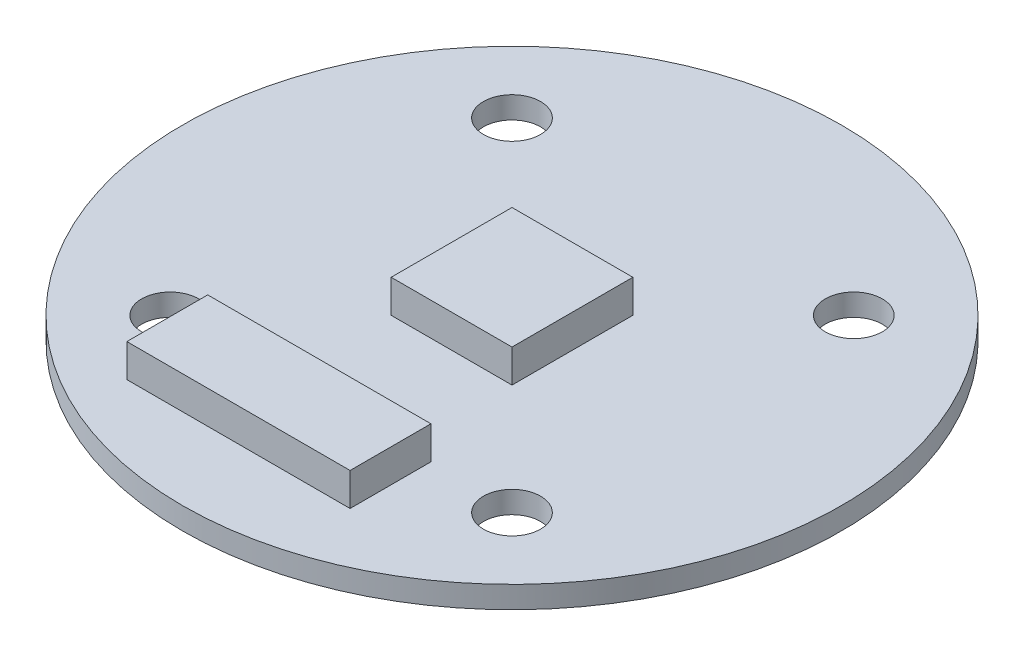
ISO-10303-21;
HEADER;
FILE_DESCRIPTION(('STEP AP214'),'2;1');
FILE_NAME('part.step','',(''),(''),'','','');
FILE_SCHEMA(('AUTOMOTIVE_DESIGN { 1 0 10303 214 1 1 1 1 }'));
ENDSEC;
DATA;
#1=APPLICATION_CONTEXT('core data for automotive mechanical design processes');
#2=APPLICATION_PROTOCOL_DEFINITION('international standard','automotive_design',2000,#1);
#3=PRODUCT_CONTEXT('',#1,'mechanical');
#4=PRODUCT('Part','Part','',(#3));
#5=PRODUCT_RELATED_PRODUCT_CATEGORY('part','',(#4));
#6=PRODUCT_DEFINITION_FORMATION('','',#4);
#7=PRODUCT_DEFINITION_CONTEXT('part definition',#1,'design');
#8=PRODUCT_DEFINITION('design','',#6,#7);
#9=PRODUCT_DEFINITION_SHAPE('','',#8);
#10=(LENGTH_UNIT() NAMED_UNIT(*) SI_UNIT(.MILLI.,.METRE.));
#11=(NAMED_UNIT(*) PLANE_ANGLE_UNIT() SI_UNIT($,.RADIAN.));
#12=(NAMED_UNIT(*) SI_UNIT($,.STERADIAN.) SOLID_ANGLE_UNIT());
#13=UNCERTAINTY_MEASURE_WITH_UNIT(LENGTH_MEASURE(1.E-05),#10,'distance_accuracy_value','');
#14=(GEOMETRIC_REPRESENTATION_CONTEXT(3) GLOBAL_UNCERTAINTY_ASSIGNED_CONTEXT((#13)) GLOBAL_UNIT_ASSIGNED_CONTEXT((#10,
#11,#12)) REPRESENTATION_CONTEXT('',''));
#15=CARTESIAN_POINT('',(0.,0.,0.));
#16=DIRECTION('',(0.,0.,1.));
#17=DIRECTION('',(1.,0.,0.));
#18=AXIS2_PLACEMENT_3D('',#15,#16,#17);
#19=CARTESIAN_POINT('',(7.77817459305198,1.,-7.77817459305251));
#20=DIRECTION('',(0.,-1.,0.));
#21=DIRECTION('',(0.,0.,-1.));
#22=AXIS2_PLACEMENT_3D('',#19,#20,#21);
#23=CYLINDRICAL_SURFACE('',#22,1.3);
#24=CARTESIAN_POINT('',(7.77817459305198,1.,-7.77817459305251));
#25=DIRECTION('',(0.,1.,0.));
#26=DIRECTION('',(0.,0.,1.));
#27=AXIS2_PLACEMENT_3D('',#24,#25,#26);
#28=CIRCLE('',#27,1.3);
#29=CARTESIAN_POINT('',(7.77817459305198,1.,-6.47817459305251));
#30=VERTEX_POINT('',#29);
#31=EDGE_CURVE('E47',#30,#30,#28,.T.);
#32=ORIENTED_EDGE('',*,*,#31,.T.);
#33=EDGE_LOOP('',(#32));
#34=FACE_BOUND('',#33,.T.);
#35=CARTESIAN_POINT('',(7.77817459305198,0.,-7.77817459305251));
#36=DIRECTION('',(0.,1.,0.));
#37=DIRECTION('',(0.,0.,1.));
#38=AXIS2_PLACEMENT_3D('',#35,#36,#37);
#39=CIRCLE('',#38,1.3);
#40=CARTESIAN_POINT('',(7.77817459305198,0.,-6.47817459305251));
#41=VERTEX_POINT('',#40);
#42=EDGE_CURVE('E244',#41,#41,#39,.T.);
#43=ORIENTED_EDGE('',*,*,#42,.F.);
#44=EDGE_LOOP('',(#43));
#45=FACE_BOUND('',#44,.T.);
#46=ADVANCED_FACE('F38',(#34,#45),#23,.F.);
#47=CARTESIAN_POINT('',(7.77817459305251,1.,7.77817459305153));
#48=DIRECTION('',(0.,-1.,0.));
#49=DIRECTION('',(0.,0.,-1.));
#50=AXIS2_PLACEMENT_3D('',#47,#48,#49);
#51=CYLINDRICAL_SURFACE('',#50,1.3);
#52=CARTESIAN_POINT('',(7.77817459305251,1.,7.77817459305153));
#53=DIRECTION('',(0.,1.,0.));
#54=DIRECTION('',(0.,0.,1.));
#55=AXIS2_PLACEMENT_3D('',#52,#53,#54);
#56=CIRCLE('',#55,1.3);
#57=CARTESIAN_POINT('',(7.77817459305251,1.,9.07817459305153));
#58=VERTEX_POINT('',#57);
#59=EDGE_CURVE('E232',#58,#58,#56,.T.);
#60=ORIENTED_EDGE('',*,*,#59,.T.);
#61=EDGE_LOOP('',(#60));
#62=FACE_BOUND('',#61,.T.);
#63=CARTESIAN_POINT('',(7.77817459305251,0.,7.77817459305153));
#64=DIRECTION('',(0.,1.,0.));
#65=DIRECTION('',(0.,0.,1.));
#66=AXIS2_PLACEMENT_3D('',#63,#64,#65);
#67=CIRCLE('',#66,1.3);
#68=CARTESIAN_POINT('',(7.77817459305251,0.,9.07817459305153));
#69=VERTEX_POINT('',#68);
#70=EDGE_CURVE('E242',#69,#69,#67,.T.);
#71=ORIENTED_EDGE('',*,*,#70,.F.);
#72=EDGE_LOOP('',(#71));
#73=FACE_BOUND('',#72,.T.);
#74=ADVANCED_FACE('F270',(#62,#73),#51,.F.);
#75=CARTESIAN_POINT('',(-7.77817459305153,1.,7.77817459305207));
#76=DIRECTION('',(0.,-1.,0.));
#77=DIRECTION('',(0.,0.,-1.));
#78=AXIS2_PLACEMENT_3D('',#75,#76,#77);
#79=CYLINDRICAL_SURFACE('',#78,1.3);
#80=CARTESIAN_POINT('',(-7.77817459305153,1.,7.77817459305207));
#81=DIRECTION('',(0.,1.,0.));
#82=DIRECTION('',(0.,0.,1.));
#83=AXIS2_PLACEMENT_3D('',#80,#81,#82);
#84=CIRCLE('',#83,1.3);
#85=CARTESIAN_POINT('',(-7.77817459305153,1.,9.07817459305207));
#86=VERTEX_POINT('',#85);
#87=EDGE_CURVE('E229',#86,#86,#84,.T.);
#88=ORIENTED_EDGE('',*,*,#87,.T.);
#89=EDGE_LOOP('',(#88));
#90=FACE_BOUND('',#89,.T.);
#91=CARTESIAN_POINT('',(-7.77817459305153,0.,7.77817459305207));
#92=DIRECTION('',(0.,1.,0.));
#93=DIRECTION('',(0.,0.,1.));
#94=AXIS2_PLACEMENT_3D('',#91,#92,#93);
#95=CIRCLE('',#94,1.3);
#96=CARTESIAN_POINT('',(-7.77817459305153,0.,9.07817459305207));
#97=VERTEX_POINT('',#96);
#98=EDGE_CURVE('E239',#97,#97,#95,.T.);
#99=ORIENTED_EDGE('',*,*,#98,.F.);
#100=EDGE_LOOP('',(#99));
#101=FACE_BOUND('',#100,.T.);
#102=ADVANCED_FACE('F276',(#90,#101),#79,.F.);
#103=CARTESIAN_POINT('',(-7.77817459305206,1.,-7.77817459305198));
#104=DIRECTION('',(0.,-1.,0.));
#105=DIRECTION('',(0.,0.,-1.));
#106=AXIS2_PLACEMENT_3D('',#103,#104,#105);
#107=CYLINDRICAL_SURFACE('',#106,1.3);
#108=CARTESIAN_POINT('',(-7.77817459305206,1.,-7.77817459305198));
#109=DIRECTION('',(0.,1.,0.));
#110=DIRECTION('',(0.,0.,1.));
#111=AXIS2_PLACEMENT_3D('',#108,#109,#110);
#112=CIRCLE('',#111,1.3);
#113=CARTESIAN_POINT('',(-7.77817459305206,1.,-6.47817459305198));
#114=VERTEX_POINT('',#113);
#115=EDGE_CURVE('E226',#114,#114,#112,.T.);
#116=ORIENTED_EDGE('',*,*,#115,.T.);
#117=EDGE_LOOP('',(#116));
#118=FACE_BOUND('',#117,.T.);
#119=CARTESIAN_POINT('',(-7.77817459305206,0.,-7.77817459305198));
#120=DIRECTION('',(0.,1.,0.));
#121=DIRECTION('',(0.,0.,1.));
#122=AXIS2_PLACEMENT_3D('',#119,#120,#121);
#123=CIRCLE('',#122,1.3);
#124=CARTESIAN_POINT('',(-7.77817459305206,0.,-6.47817459305198));
#125=VERTEX_POINT('',#124);
#126=EDGE_CURVE('E225',#125,#125,#123,.T.);
#127=ORIENTED_EDGE('',*,*,#126,.F.);
#128=EDGE_LOOP('',(#127));
#129=FACE_BOUND('',#128,.T.);
#130=ADVANCED_FACE('F40',(#118,#129),#107,.F.);
#131=CARTESIAN_POINT('',(0.,1.,0.));
#132=DIRECTION('',(0.,-1.,0.));
#133=DIRECTION('',(0.,0.,-1.));
#134=AXIS2_PLACEMENT_3D('',#131,#132,#133);
#135=CYLINDRICAL_SURFACE('',#134,15.);
#136=CARTESIAN_POINT('',(0.,1.,0.));
#137=DIRECTION('',(0.,1.,0.));
#138=DIRECTION('',(0.,0.,1.));
#139=AXIS2_PLACEMENT_3D('',#136,#137,#138);
#140=CIRCLE('',#139,15.);
#141=CARTESIAN_POINT('',(0.,1.,15.));
#142=VERTEX_POINT('',#141);
#143=EDGE_CURVE('E11',#142,#142,#140,.T.);
#144=ORIENTED_EDGE('',*,*,#143,.F.);
#145=EDGE_LOOP('',(#144));
#146=FACE_BOUND('',#145,.T.);
#147=CARTESIAN_POINT('',(0.,0.,0.));
#148=DIRECTION('',(0.,1.,0.));
#149=DIRECTION('',(0.,0.,1.));
#150=AXIS2_PLACEMENT_3D('',#147,#148,#149);
#151=CIRCLE('',#150,15.);
#152=CARTESIAN_POINT('',(0.,0.,15.));
#153=VERTEX_POINT('',#152);
#154=EDGE_CURVE('E42',#153,#153,#151,.T.);
#155=ORIENTED_EDGE('',*,*,#154,.T.);
#156=EDGE_LOOP('',(#155));
#157=FACE_BOUND('',#156,.T.);
#158=ADVANCED_FACE('F251',(#146,#157),#135,.T.);
#159=CARTESIAN_POINT('',(0.,1.,0.));
#160=DIRECTION('',(0.,1.,0.));
#161=DIRECTION('',(0.,0.,1.));
#162=AXIS2_PLACEMENT_3D('',#159,#160,#161);
#163=PLANE('',#162);
#164=DIRECTION('',(0.,0.,1.));
#165=VECTOR('',#164,1.);
#166=CARTESIAN_POINT('',(3.93,1.,0.));
#167=LINE('',#166,#165);
#168=CARTESIAN_POINT('',(3.93,1.,7.62));
#169=VERTEX_POINT('',#168);
#170=CARTESIAN_POINT('',(3.93,1.,11.3));
#171=VERTEX_POINT('',#170);
#172=EDGE_CURVE('E136',#169,#171,#167,.T.);
#173=ORIENTED_EDGE('',*,*,#172,.T.);
#174=DIRECTION('',(1.,0.,0.));
#175=VECTOR('',#174,1.);
#176=CARTESIAN_POINT('',(0.,1.,11.3));
#177=LINE('',#176,#175);
#178=CARTESIAN_POINT('',(-6.23,1.,11.3));
#179=VERTEX_POINT('',#178);
#180=EDGE_CURVE('E170',#179,#171,#177,.T.);
#181=ORIENTED_EDGE('',*,*,#180,.F.);
#182=DIRECTION('',(0.,0.,1.));
#183=VECTOR('',#182,1.);
#184=CARTESIAN_POINT('',(-6.23,1.,0.));
#185=LINE('',#184,#183);
#186=CARTESIAN_POINT('',(-6.23,1.,7.62));
#187=VERTEX_POINT('',#186);
#188=EDGE_CURVE('E183',#187,#179,#185,.T.);
#189=ORIENTED_EDGE('',*,*,#188,.F.);
#190=DIRECTION('',(1.,0.,0.));
#191=VECTOR('',#190,1.);
#192=CARTESIAN_POINT('',(0.,1.,7.62));
#193=LINE('',#192,#191);
#194=EDGE_CURVE('E180',#187,#169,#193,.T.);
#195=ORIENTED_EDGE('',*,*,#194,.T.);
#196=EDGE_LOOP('',(#173,#181,#189,#195));
#197=FACE_BOUND('',#196,.T.);
#198=DIRECTION('',(0.,0.,-1.));
#199=VECTOR('',#198,1.);
#200=CARTESIAN_POINT('',(-2.75,1.,0.));
#201=LINE('',#200,#199);
#202=CARTESIAN_POINT('',(-2.75,1.,2.75));
#203=VERTEX_POINT('',#202);
#204=CARTESIAN_POINT('',(-2.75,1.,-2.75));
#205=VERTEX_POINT('',#204);
#206=EDGE_CURVE('E195',#203,#205,#201,.T.);
#207=ORIENTED_EDGE('',*,*,#206,.T.);
#208=DIRECTION('',(-1.,0.,0.));
#209=VECTOR('',#208,1.);
#210=CARTESIAN_POINT('',(0.,1.,-2.75));
#211=LINE('',#210,#209);
#212=CARTESIAN_POINT('',(2.75,1.,-2.75));
#213=VERTEX_POINT('',#212);
#214=EDGE_CURVE('E200',#213,#205,#211,.T.);
#215=ORIENTED_EDGE('',*,*,#214,.F.);
#216=DIRECTION('',(0.,0.,-1.));
#217=VECTOR('',#216,1.);
#218=CARTESIAN_POINT('',(2.75,1.,0.));
#219=LINE('',#218,#217);
#220=CARTESIAN_POINT('',(2.75,1.,2.75));
#221=VERTEX_POINT('',#220);
#222=EDGE_CURVE('E213',#221,#213,#219,.T.);
#223=ORIENTED_EDGE('',*,*,#222,.F.);
#224=DIRECTION('',(-1.,0.,0.));
#225=VECTOR('',#224,1.);
#226=CARTESIAN_POINT('',(0.,1.,2.75));
#227=LINE('',#226,#225);
#228=EDGE_CURVE('E210',#221,#203,#227,.T.);
#229=ORIENTED_EDGE('',*,*,#228,.T.);
#230=EDGE_LOOP('',(#207,#215,#223,#229));
#231=FACE_BOUND('',#230,.T.);
#232=ORIENTED_EDGE('',*,*,#115,.F.);
#233=EDGE_LOOP('',(#232));
#234=FACE_BOUND('',#233,.T.);
#235=ORIENTED_EDGE('',*,*,#87,.F.);
#236=EDGE_LOOP('',(#235));
#237=FACE_BOUND('',#236,.T.);
#238=ORIENTED_EDGE('',*,*,#59,.F.);
#239=EDGE_LOOP('',(#238));
#240=FACE_BOUND('',#239,.T.);
#241=ORIENTED_EDGE('',*,*,#31,.F.);
#242=EDGE_LOOP('',(#241));
#243=FACE_BOUND('',#242,.T.);
#244=ORIENTED_EDGE('',*,*,#143,.T.);
#245=EDGE_LOOP('',(#244));
#246=FACE_BOUND('',#245,.T.);
#247=ADVANCED_FACE('F256',(#197,#231,#234,#237,#240,#243,#246),#163,.T.);
#248=CARTESIAN_POINT('',(0.,0.,0.));
#249=DIRECTION('',(0.,1.,0.));
#250=DIRECTION('',(0.,0.,1.));
#251=AXIS2_PLACEMENT_3D('',#248,#249,#250);
#252=PLANE('',#251);
#253=DIRECTION('',(-1.,0.,0.));
#254=VECTOR('',#253,1.);
#255=CARTESIAN_POINT('',(0.,0.,-1.685));
#256=LINE('',#255,#254);
#257=CARTESIAN_POINT('',(2.5,0.,-1.685));
#258=VERTEX_POINT('',#257);
#259=CARTESIAN_POINT('',(-2.5,0.,-1.685));
#260=VERTEX_POINT('',#259);
#261=EDGE_CURVE('E55',#258,#260,#256,.T.);
#262=ORIENTED_EDGE('',*,*,#261,.T.);
#263=DIRECTION('',(0.,0.,1.));
#264=VECTOR('',#263,1.);
#265=CARTESIAN_POINT('',(-2.5,0.,0.));
#266=LINE('',#265,#264);
#267=CARTESIAN_POINT('',(-2.5,0.,1.685));
#268=VERTEX_POINT('',#267);
#269=EDGE_CURVE('E133',#260,#268,#266,.T.);
#270=ORIENTED_EDGE('',*,*,#269,.T.);
#271=DIRECTION('',(-1.,0.,0.));
#272=VECTOR('',#271,1.);
#273=CARTESIAN_POINT('',(0.,0.,1.685));
#274=LINE('',#273,#272);
#275=CARTESIAN_POINT('',(2.5,0.,1.685));
#276=VERTEX_POINT('',#275);
#277=EDGE_CURVE('E146',#276,#268,#274,.T.);
#278=ORIENTED_EDGE('',*,*,#277,.F.);
#279=DIRECTION('',(0.,0.,1.));
#280=VECTOR('',#279,1.);
#281=CARTESIAN_POINT('',(2.5,0.,0.));
#282=LINE('',#281,#280);
#283=EDGE_CURVE('E60',#258,#276,#282,.T.);
#284=ORIENTED_EDGE('',*,*,#283,.F.);
#285=EDGE_LOOP('',(#262,#270,#278,#284));
#286=FACE_BOUND('',#285,.T.);
#287=ORIENTED_EDGE('',*,*,#126,.T.);
#288=EDGE_LOOP('',(#287));
#289=FACE_BOUND('',#288,.T.);
#290=ORIENTED_EDGE('',*,*,#98,.T.);
#291=EDGE_LOOP('',(#290));
#292=FACE_BOUND('',#291,.T.);
#293=ORIENTED_EDGE('',*,*,#70,.T.);
#294=EDGE_LOOP('',(#293));
#295=FACE_BOUND('',#294,.T.);
#296=ORIENTED_EDGE('',*,*,#42,.T.);
#297=EDGE_LOOP('',(#296));
#298=FACE_BOUND('',#297,.T.);
#299=ORIENTED_EDGE('',*,*,#154,.F.);
#300=EDGE_LOOP('',(#299));
#301=FACE_BOUND('',#300,.T.);
#302=ADVANCED_FACE('F253',(#286,#289,#292,#295,#298,#301),#252,.F.);
#303=CARTESIAN_POINT('',(-2.75,2.5,0.));
#304=DIRECTION('',(-1.,0.,0.));
#305=DIRECTION('',(0.,0.,1.));
#306=AXIS2_PLACEMENT_3D('',#303,#304,#305);
#307=PLANE('',#306);
#308=ORIENTED_EDGE('',*,*,#206,.F.);
#309=DIRECTION('',(0.,-1.,0.));
#310=VECTOR('',#309,1.);
#311=CARTESIAN_POINT('',(-2.75,2.5,2.75));
#312=LINE('',#311,#310);
#313=CARTESIAN_POINT('',(-2.75,2.5,2.75));
#314=VERTEX_POINT('',#313);
#315=EDGE_CURVE('E223',#314,#203,#312,.T.);
#316=ORIENTED_EDGE('',*,*,#315,.F.);
#317=DIRECTION('',(0.,0.,-1.));
#318=VECTOR('',#317,1.);
#319=CARTESIAN_POINT('',(-2.75,2.5,0.));
#320=LINE('',#319,#318);
#321=CARTESIAN_POINT('',(-2.75,2.5,-2.75));
#322=VERTEX_POINT('',#321);
#323=EDGE_CURVE('E196',#314,#322,#320,.T.);
#324=ORIENTED_EDGE('',*,*,#323,.T.);
#325=DIRECTION('',(0.,-1.,0.));
#326=VECTOR('',#325,1.);
#327=CARTESIAN_POINT('',(-2.75,2.5,-2.75));
#328=LINE('',#327,#326);
#329=EDGE_CURVE('E207',#322,#205,#328,.T.);
#330=ORIENTED_EDGE('',*,*,#329,.T.);
#331=EDGE_LOOP('',(#308,#316,#324,#330));
#332=FACE_BOUND('',#331,.T.);
#333=ADVANCED_FACE('F255',(#332),#307,.T.);
#334=CARTESIAN_POINT('',(0.,2.5,2.75));
#335=DIRECTION('',(0.,0.,1.));
#336=DIRECTION('',(1.,0.,0.));
#337=AXIS2_PLACEMENT_3D('',#334,#335,#336);
#338=PLANE('',#337);
#339=ORIENTED_EDGE('',*,*,#228,.F.);
#340=DIRECTION('',(0.,-1.,0.));
#341=VECTOR('',#340,1.);
#342=CARTESIAN_POINT('',(2.75,2.5,2.75));
#343=LINE('',#342,#341);
#344=CARTESIAN_POINT('',(2.75,2.5,2.75));
#345=VERTEX_POINT('',#344);
#346=EDGE_CURVE('E221',#345,#221,#343,.T.);
#347=ORIENTED_EDGE('',*,*,#346,.F.);
#348=DIRECTION('',(-1.,0.,0.));
#349=VECTOR('',#348,1.);
#350=CARTESIAN_POINT('',(0.,2.5,2.75));
#351=LINE('',#350,#349);
#352=EDGE_CURVE('E199',#345,#314,#351,.T.);
#353=ORIENTED_EDGE('',*,*,#352,.T.);
#354=ORIENTED_EDGE('',*,*,#315,.T.);
#355=EDGE_LOOP('',(#339,#347,#353,#354));
#356=FACE_BOUND('',#355,.T.);
#357=ADVANCED_FACE('F262',(#356),#338,.T.);
#358=CARTESIAN_POINT('',(2.75,2.5,0.));
#359=DIRECTION('',(-1.,0.,0.));
#360=DIRECTION('',(0.,0.,1.));
#361=AXIS2_PLACEMENT_3D('',#358,#359,#360);
#362=PLANE('',#361);
#363=ORIENTED_EDGE('',*,*,#222,.T.);
#364=DIRECTION('',(0.,-1.,0.));
#365=VECTOR('',#364,1.);
#366=CARTESIAN_POINT('',(2.75,2.5,-2.75));
#367=LINE('',#366,#365);
#368=CARTESIAN_POINT('',(2.75,2.5,-2.75));
#369=VERTEX_POINT('',#368);
#370=EDGE_CURVE('E219',#369,#213,#367,.T.);
#371=ORIENTED_EDGE('',*,*,#370,.F.);
#372=DIRECTION('',(0.,0.,-1.));
#373=VECTOR('',#372,1.);
#374=CARTESIAN_POINT('',(2.75,2.5,0.));
#375=LINE('',#374,#373);
#376=EDGE_CURVE('E203',#345,#369,#375,.T.);
#377=ORIENTED_EDGE('',*,*,#376,.F.);
#378=ORIENTED_EDGE('',*,*,#346,.T.);
#379=EDGE_LOOP('',(#363,#371,#377,#378));
#380=FACE_BOUND('',#379,.T.);
#381=ADVANCED_FACE('F363',(#380),#362,.F.);
#382=CARTESIAN_POINT('',(0.,2.5,-2.75));
#383=DIRECTION('',(0.,0.,1.));
#384=DIRECTION('',(1.,0.,0.));
#385=AXIS2_PLACEMENT_3D('',#382,#383,#384);
#386=PLANE('',#385);
#387=ORIENTED_EDGE('',*,*,#214,.T.);
#388=ORIENTED_EDGE('',*,*,#329,.F.);
#389=DIRECTION('',(-1.,0.,0.));
#390=VECTOR('',#389,1.);
#391=CARTESIAN_POINT('',(0.,2.5,-2.75));
#392=LINE('',#391,#390);
#393=EDGE_CURVE('E205',#369,#322,#392,.T.);
#394=ORIENTED_EDGE('',*,*,#393,.F.);
#395=ORIENTED_EDGE('',*,*,#370,.T.);
#396=EDGE_LOOP('',(#387,#388,#394,#395));
#397=FACE_BOUND('',#396,.T.);
#398=ADVANCED_FACE('F373',(#397),#386,.F.);
#399=CARTESIAN_POINT('',(0.,2.5,0.));
#400=DIRECTION('',(0.,1.,0.));
#401=DIRECTION('',(0.,0.,1.));
#402=AXIS2_PLACEMENT_3D('',#399,#400,#401);
#403=PLANE('',#402);
#404=ORIENTED_EDGE('',*,*,#323,.F.);
#405=ORIENTED_EDGE('',*,*,#352,.F.);
#406=ORIENTED_EDGE('',*,*,#376,.T.);
#407=ORIENTED_EDGE('',*,*,#393,.T.);
#408=EDGE_LOOP('',(#404,#405,#406,#407));
#409=FACE_BOUND('',#408,.T.);
#410=ADVANCED_FACE('F383',(#409),#403,.T.);
#411=CARTESIAN_POINT('',(3.93,2.5,0.));
#412=DIRECTION('',(1.,0.,0.));
#413=DIRECTION('',(0.,0.,-1.));
#414=AXIS2_PLACEMENT_3D('',#411,#412,#413);
#415=PLANE('',#414);
#416=ORIENTED_EDGE('',*,*,#172,.F.);
#417=DIRECTION('',(0.,-1.,0.));
#418=VECTOR('',#417,1.);
#419=CARTESIAN_POINT('',(3.93,2.5,7.62));
#420=LINE('',#419,#418);
#421=CARTESIAN_POINT('',(3.93,2.5,7.62));
#422=VERTEX_POINT('',#421);
#423=EDGE_CURVE('E193',#422,#169,#420,.T.);
#424=ORIENTED_EDGE('',*,*,#423,.F.);
#425=DIRECTION('',(0.,0.,1.));
#426=VECTOR('',#425,1.);
#427=CARTESIAN_POINT('',(3.93,2.5,0.));
#428=LINE('',#427,#426);
#429=CARTESIAN_POINT('',(3.93,2.5,11.3));
#430=VERTEX_POINT('',#429);
#431=EDGE_CURVE('E166',#422,#430,#428,.T.);
#432=ORIENTED_EDGE('',*,*,#431,.T.);
#433=DIRECTION('',(0.,-1.,0.));
#434=VECTOR('',#433,1.);
#435=CARTESIAN_POINT('',(3.93,2.5,11.3));
#436=LINE('',#435,#434);
#437=EDGE_CURVE('E177',#430,#171,#436,.T.);
#438=ORIENTED_EDGE('',*,*,#437,.T.);
#439=EDGE_LOOP('',(#416,#424,#432,#438));
#440=FACE_BOUND('',#439,.T.);
#441=ADVANCED_FACE('F393',(#440),#415,.T.);
#442=CARTESIAN_POINT('',(0.,2.5,7.62));
#443=DIRECTION('',(0.,0.,-1.));
#444=DIRECTION('',(-1.,0.,0.));
#445=AXIS2_PLACEMENT_3D('',#442,#443,#444);
#446=PLANE('',#445);
#447=ORIENTED_EDGE('',*,*,#194,.F.);
#448=DIRECTION('',(0.,-1.,0.));
#449=VECTOR('',#448,1.);
#450=CARTESIAN_POINT('',(-6.23,2.5,7.62));
#451=LINE('',#450,#449);
#452=CARTESIAN_POINT('',(-6.23,2.5,7.62));
#453=VERTEX_POINT('',#452);
#454=EDGE_CURVE('E191',#453,#187,#451,.T.);
#455=ORIENTED_EDGE('',*,*,#454,.F.);
#456=DIRECTION('',(1.,0.,0.));
#457=VECTOR('',#456,1.);
#458=CARTESIAN_POINT('',(0.,2.5,7.62));
#459=LINE('',#458,#457);
#460=EDGE_CURVE('E169',#453,#422,#459,.T.);
#461=ORIENTED_EDGE('',*,*,#460,.T.);
#462=ORIENTED_EDGE('',*,*,#423,.T.);
#463=EDGE_LOOP('',(#447,#455,#461,#462));
#464=FACE_BOUND('',#463,.T.);
#465=ADVANCED_FACE('F403',(#464),#446,.T.);
#466=CARTESIAN_POINT('',(-6.23,2.5,0.));
#467=DIRECTION('',(1.,0.,0.));
#468=DIRECTION('',(0.,0.,-1.));
#469=AXIS2_PLACEMENT_3D('',#466,#467,#468);
#470=PLANE('',#469);
#471=ORIENTED_EDGE('',*,*,#188,.T.);
#472=DIRECTION('',(0.,-1.,0.));
#473=VECTOR('',#472,1.);
#474=CARTESIAN_POINT('',(-6.23,2.5,11.3));
#475=LINE('',#474,#473);
#476=CARTESIAN_POINT('',(-6.23,2.5,11.3));
#477=VERTEX_POINT('',#476);
#478=EDGE_CURVE('E189',#477,#179,#475,.T.);
#479=ORIENTED_EDGE('',*,*,#478,.F.);
#480=DIRECTION('',(0.,0.,1.));
#481=VECTOR('',#480,1.);
#482=CARTESIAN_POINT('',(-6.23,2.5,0.));
#483=LINE('',#482,#481);
#484=EDGE_CURVE('E173',#453,#477,#483,.T.);
#485=ORIENTED_EDGE('',*,*,#484,.F.);
#486=ORIENTED_EDGE('',*,*,#454,.T.);
#487=EDGE_LOOP('',(#471,#479,#485,#486));
#488=FACE_BOUND('',#487,.T.);
#489=ADVANCED_FACE('F413',(#488),#470,.F.);
#490=CARTESIAN_POINT('',(0.,2.5,11.3));
#491=DIRECTION('',(0.,0.,-1.));
#492=DIRECTION('',(-1.,0.,0.));
#493=AXIS2_PLACEMENT_3D('',#490,#491,#492);
#494=PLANE('',#493);
#495=ORIENTED_EDGE('',*,*,#180,.T.);
#496=ORIENTED_EDGE('',*,*,#437,.F.);
#497=DIRECTION('',(1.,0.,0.));
#498=VECTOR('',#497,1.);
#499=CARTESIAN_POINT('',(0.,2.5,11.3));
#500=LINE('',#499,#498);
#501=EDGE_CURVE('E175',#477,#430,#500,.T.);
#502=ORIENTED_EDGE('',*,*,#501,.F.);
#503=ORIENTED_EDGE('',*,*,#478,.T.);
#504=EDGE_LOOP('',(#495,#496,#502,#503));
#505=FACE_BOUND('',#504,.T.);
#506=ADVANCED_FACE('F423',(#505),#494,.F.);
#507=CARTESIAN_POINT('',(0.,2.5,0.));
#508=DIRECTION('',(0.,1.,0.));
#509=DIRECTION('',(0.,0.,1.));
#510=AXIS2_PLACEMENT_3D('',#507,#508,#509);
#511=PLANE('',#510);
#512=ORIENTED_EDGE('',*,*,#431,.F.);
#513=ORIENTED_EDGE('',*,*,#460,.F.);
#514=ORIENTED_EDGE('',*,*,#484,.T.);
#515=ORIENTED_EDGE('',*,*,#501,.T.);
#516=EDGE_LOOP('',(#512,#513,#514,#515));
#517=FACE_BOUND('',#516,.T.);
#518=ADVANCED_FACE('F433',(#517),#511,.T.);
#519=CARTESIAN_POINT('',(-2.5,-1.5,0.));
#520=DIRECTION('',(-1.,0.,0.));
#521=DIRECTION('',(0.,0.,1.));
#522=AXIS2_PLACEMENT_3D('',#519,#520,#521);
#523=PLANE('',#522);
#524=ORIENTED_EDGE('',*,*,#269,.F.);
#525=DIRECTION('',(0.,1.,0.));
#526=VECTOR('',#525,1.);
#527=CARTESIAN_POINT('',(-2.5,-1.5,-1.685));
#528=LINE('',#527,#526);
#529=CARTESIAN_POINT('',(-2.5,-1.5,-1.685));
#530=VERTEX_POINT('',#529);
#531=EDGE_CURVE('E128',#530,#260,#528,.T.);
#532=ORIENTED_EDGE('',*,*,#531,.F.);
#533=DIRECTION('',(0.,0.,1.));
#534=VECTOR('',#533,1.);
#535=CARTESIAN_POINT('',(-2.5,-1.5,0.));
#536=LINE('',#535,#534);
#537=CARTESIAN_POINT('',(-2.5,-1.5,1.685));
#538=VERTEX_POINT('',#537);
#539=EDGE_CURVE('E132',#530,#538,#536,.T.);
#540=ORIENTED_EDGE('',*,*,#539,.T.);
#541=DIRECTION('',(0.,1.,0.));
#542=VECTOR('',#541,1.);
#543=CARTESIAN_POINT('',(-2.5,-1.5,1.685));
#544=LINE('',#543,#542);
#545=EDGE_CURVE('E155',#538,#268,#544,.T.);
#546=ORIENTED_EDGE('',*,*,#545,.T.);
#547=EDGE_LOOP('',(#524,#532,#540,#546));
#548=FACE_BOUND('',#547,.T.);
#549=ADVANCED_FACE('F130',(#548),#523,.T.);
#550=CARTESIAN_POINT('',(0.,-1.5,-1.685));
#551=DIRECTION('',(0.,0.,-1.));
#552=DIRECTION('',(-1.,0.,0.));
#553=AXIS2_PLACEMENT_3D('',#550,#551,#552);
#554=PLANE('',#553);
#555=ORIENTED_EDGE('',*,*,#261,.F.);
#556=DIRECTION('',(0.,1.,0.));
#557=VECTOR('',#556,1.);
#558=CARTESIAN_POINT('',(2.5,-1.5,-1.685));
#559=LINE('',#558,#557);
#560=CARTESIAN_POINT('',(2.5,-1.5,-1.685));
#561=VERTEX_POINT('',#560);
#562=EDGE_CURVE('E137',#561,#258,#559,.T.);
#563=ORIENTED_EDGE('',*,*,#562,.F.);
#564=DIRECTION('',(-1.,0.,0.));
#565=VECTOR('',#564,1.);
#566=CARTESIAN_POINT('',(0.,-1.5,-1.685));
#567=LINE('',#566,#565);
#568=EDGE_CURVE('E142',#561,#530,#567,.T.);
#569=ORIENTED_EDGE('',*,*,#568,.T.);
#570=ORIENTED_EDGE('',*,*,#531,.T.);
#571=EDGE_LOOP('',(#555,#563,#569,#570));
#572=FACE_BOUND('',#571,.T.);
#573=ADVANCED_FACE('F148',(#572),#554,.T.);
#574=CARTESIAN_POINT('',(2.5,-1.5,0.));
#575=DIRECTION('',(-1.,0.,0.));
#576=DIRECTION('',(0.,0.,1.));
#577=AXIS2_PLACEMENT_3D('',#574,#575,#576);
#578=PLANE('',#577);
#579=ORIENTED_EDGE('',*,*,#283,.T.);
#580=DIRECTION('',(0.,1.,0.));
#581=VECTOR('',#580,1.);
#582=CARTESIAN_POINT('',(2.5,-1.5,1.685));
#583=LINE('',#582,#581);
#584=CARTESIAN_POINT('',(2.5,-1.5,1.685));
#585=VERTEX_POINT('',#584);
#586=EDGE_CURVE('E162',#585,#276,#583,.T.);
#587=ORIENTED_EDGE('',*,*,#586,.F.);
#588=DIRECTION('',(0.,0.,1.));
#589=VECTOR('',#588,1.);
#590=CARTESIAN_POINT('',(2.5,-1.5,0.));
#591=LINE('',#590,#589);
#592=EDGE_CURVE('E150',#561,#585,#591,.T.);
#593=ORIENTED_EDGE('',*,*,#592,.F.);
#594=ORIENTED_EDGE('',*,*,#562,.T.);
#595=EDGE_LOOP('',(#579,#587,#593,#594));
#596=FACE_BOUND('',#595,.T.);
#597=ADVANCED_FACE('F458',(#596),#578,.F.);
#598=CARTESIAN_POINT('',(0.,-1.5,1.685));
#599=DIRECTION('',(0.,0.,-1.));
#600=DIRECTION('',(-1.,0.,0.));
#601=AXIS2_PLACEMENT_3D('',#598,#599,#600);
#602=PLANE('',#601);
#603=ORIENTED_EDGE('',*,*,#277,.T.);
#604=ORIENTED_EDGE('',*,*,#545,.F.);
#605=DIRECTION('',(-1.,0.,0.));
#606=VECTOR('',#605,1.);
#607=CARTESIAN_POINT('',(0.,-1.5,1.685));
#608=LINE('',#607,#606);
#609=EDGE_CURVE('E144',#585,#538,#608,.T.);
#610=ORIENTED_EDGE('',*,*,#609,.F.);
#611=ORIENTED_EDGE('',*,*,#586,.T.);
#612=EDGE_LOOP('',(#603,#604,#610,#611));
#613=FACE_BOUND('',#612,.T.);
#614=ADVANCED_FACE('F467',(#613),#602,.F.);
#615=CARTESIAN_POINT('',(0.,-1.5,0.));
#616=DIRECTION('',(0.,-1.,0.));
#617=DIRECTION('',(0.,0.,-1.));
#618=AXIS2_PLACEMENT_3D('',#615,#616,#617);
#619=PLANE('',#618);
#620=ORIENTED_EDGE('',*,*,#539,.F.);
#621=ORIENTED_EDGE('',*,*,#568,.F.);
#622=ORIENTED_EDGE('',*,*,#592,.T.);
#623=ORIENTED_EDGE('',*,*,#609,.T.);
#624=EDGE_LOOP('',(#620,#621,#622,#623));
#625=FACE_BOUND('',#624,.T.);
#626=ADVANCED_FACE('F141',(#625),#619,.T.);
#627=CLOSED_SHELL('',(#46,#74,#102,#130,#158,#247,#302,#333,#357,#381,#398,#410,#441,#465,#489,
#506,#518,#549,#573,#597,#614,#626));
#628=MANIFOLD_SOLID_BREP('B2',#627);
#629=ADVANCED_BREP_SHAPE_REPRESENTATION('',(#18,#628),#14);
#630=SHAPE_DEFINITION_REPRESENTATION(#9,#629);
ENDSEC;
END-ISO-10303-21;
